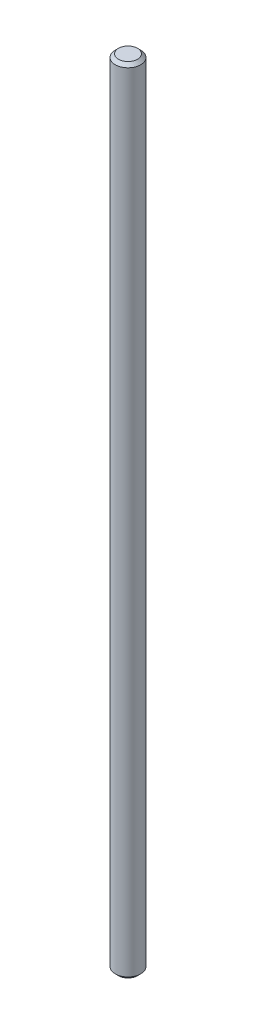
ISO-10303-21;
HEADER;
FILE_DESCRIPTION(('STEP AP214'),'2;1');
FILE_NAME('part.step','',(''),(''),'','','');
FILE_SCHEMA(('AUTOMOTIVE_DESIGN { 1 0 10303 214 1 1 1 1 }'));
ENDSEC;
DATA;
#1=APPLICATION_CONTEXT('core data for automotive mechanical design processes');
#2=APPLICATION_PROTOCOL_DEFINITION('international standard','automotive_design',2000,#1);
#3=PRODUCT_CONTEXT('',#1,'mechanical');
#4=PRODUCT('Part','Part','',(#3));
#5=PRODUCT_RELATED_PRODUCT_CATEGORY('part','',(#4));
#6=PRODUCT_DEFINITION_FORMATION('','',#4);
#7=PRODUCT_DEFINITION_CONTEXT('part definition',#1,'design');
#8=PRODUCT_DEFINITION('design','',#6,#7);
#9=PRODUCT_DEFINITION_SHAPE('','',#8);
#10=(LENGTH_UNIT() NAMED_UNIT(*) SI_UNIT(.MILLI.,.METRE.));
#11=(NAMED_UNIT(*) PLANE_ANGLE_UNIT() SI_UNIT($,.RADIAN.));
#12=(NAMED_UNIT(*) SI_UNIT($,.STERADIAN.) SOLID_ANGLE_UNIT());
#13=UNCERTAINTY_MEASURE_WITH_UNIT(LENGTH_MEASURE(1.E-05),#10,'distance_accuracy_value','');
#14=(GEOMETRIC_REPRESENTATION_CONTEXT(3) GLOBAL_UNCERTAINTY_ASSIGNED_CONTEXT((#13)) GLOBAL_UNIT_ASSIGNED_CONTEXT((#10,
#11,#12)) REPRESENTATION_CONTEXT('',''));
#15=CARTESIAN_POINT('',(0.,0.,0.));
#16=DIRECTION('',(0.,0.,1.));
#17=DIRECTION('',(1.,0.,0.));
#18=AXIS2_PLACEMENT_3D('',#15,#16,#17);
#19=CARTESIAN_POINT('',(0.,250.,0.));
#20=DIRECTION('',(0.,-1.,0.));
#21=DIRECTION('',(0.,0.,-1.));
#22=AXIS2_PLACEMENT_3D('',#19,#20,#21);
#23=CYLINDRICAL_SURFACE('',#22,4.);
#24=CARTESIAN_POINT('',(0.,1.,0.));
#25=DIRECTION('',(0.,1.,0.));
#26=DIRECTION('',(0.,0.,1.));
#27=AXIS2_PLACEMENT_3D('',#24,#25,#26);
#28=CIRCLE('',#27,4.);
#29=CARTESIAN_POINT('',(0.,1.,4.));
#30=VERTEX_POINT('',#29);
#31=EDGE_CURVE('E48',#30,#30,#28,.T.);
#32=ORIENTED_EDGE('',*,*,#31,.T.);
#33=EDGE_LOOP('',(#32));
#34=FACE_BOUND('',#33,.T.);
#35=CARTESIAN_POINT('',(0.,249.,0.));
#36=DIRECTION('',(0.,1.,0.));
#37=DIRECTION('',(0.,0.,1.));
#38=AXIS2_PLACEMENT_3D('',#35,#36,#37);
#39=CIRCLE('',#38,4.);
#40=CARTESIAN_POINT('',(0.,249.,4.));
#41=VERTEX_POINT('',#40);
#42=EDGE_CURVE('E52',#41,#41,#39,.F.);
#43=ORIENTED_EDGE('',*,*,#42,.T.);
#44=EDGE_LOOP('',(#43));
#45=FACE_BOUND('',#44,.T.);
#46=ADVANCED_FACE('F36',(#34,#45),#23,.T.);
#47=CARTESIAN_POINT('',(0.,250.,0.));
#48=DIRECTION('',(0.,1.,0.));
#49=DIRECTION('',(0.,0.,1.));
#50=AXIS2_PLACEMENT_3D('',#47,#48,#49);
#51=PLANE('',#50);
#52=CARTESIAN_POINT('',(0.,250.,0.));
#53=DIRECTION('',(0.,1.,0.));
#54=DIRECTION('',(0.,0.,1.));
#55=AXIS2_PLACEMENT_3D('',#52,#53,#54);
#56=CIRCLE('',#55,2.99999999999998);
#57=CARTESIAN_POINT('',(0.,250.,2.99999999999998));
#58=VERTEX_POINT('',#57);
#59=EDGE_CURVE('E10',#58,#58,#56,.T.);
#60=ORIENTED_EDGE('',*,*,#59,.T.);
#61=EDGE_LOOP('',(#60));
#62=FACE_BOUND('',#61,.T.);
#63=ADVANCED_FACE('F68',(#62),#51,.T.);
#64=CARTESIAN_POINT('',(0.,0.,0.));
#65=DIRECTION('',(0.,1.,0.));
#66=DIRECTION('',(0.,0.,1.));
#67=AXIS2_PLACEMENT_3D('',#64,#65,#66);
#68=PLANE('',#67);
#69=CARTESIAN_POINT('',(0.,0.,0.));
#70=DIRECTION('',(0.,1.,0.));
#71=DIRECTION('',(0.,0.,1.));
#72=AXIS2_PLACEMENT_3D('',#69,#70,#71);
#73=CIRCLE('',#72,2.99999999999998);
#74=CARTESIAN_POINT('',(0.,0.,2.99999999999998));
#75=VERTEX_POINT('',#74);
#76=EDGE_CURVE('E44',#75,#75,#73,.F.);
#77=ORIENTED_EDGE('',*,*,#76,.T.);
#78=EDGE_LOOP('',(#77));
#79=FACE_BOUND('',#78,.T.);
#80=ADVANCED_FACE('F65',(#79),#68,.F.);
#81=CARTESIAN_POINT('',(0.,1.,0.));
#82=DIRECTION('',(0.,1.,0.));
#83=DIRECTION('',(0.,0.,1.));
#84=AXIS2_PLACEMENT_3D('',#81,#82,#83);
#85=CONICAL_SURFACE('',#84,4.,0.785398163397461);
#86=ORIENTED_EDGE('',*,*,#76,.F.);
#87=EDGE_LOOP('',(#86));
#88=FACE_BOUND('',#87,.T.);
#89=ORIENTED_EDGE('',*,*,#31,.F.);
#90=EDGE_LOOP('',(#89));
#91=FACE_BOUND('',#90,.T.);
#92=ADVANCED_FACE('F61',(#88,#91),#85,.T.);
#93=CARTESIAN_POINT('',(0.,250.,0.));
#94=DIRECTION('',(0.,-1.,0.));
#95=DIRECTION('',(0.,0.,-1.));
#96=AXIS2_PLACEMENT_3D('',#93,#94,#95);
#97=CONICAL_SURFACE('',#96,2.99999999999998,0.785398163397461);
#98=ORIENTED_EDGE('',*,*,#42,.F.);
#99=EDGE_LOOP('',(#98));
#100=FACE_BOUND('',#99,.T.);
#101=ORIENTED_EDGE('',*,*,#59,.F.);
#102=EDGE_LOOP('',(#101));
#103=FACE_BOUND('',#102,.T.);
#104=ADVANCED_FACE('F39',(#100,#103),#97,.T.);
#105=CLOSED_SHELL('',(#46,#63,#80,#92,#104));
#106=MANIFOLD_SOLID_BREP('B2',#105);
#107=ADVANCED_BREP_SHAPE_REPRESENTATION('',(#18,#106),#14);
#108=SHAPE_DEFINITION_REPRESENTATION(#9,#107);
ENDSEC;
END-ISO-10303-21;
